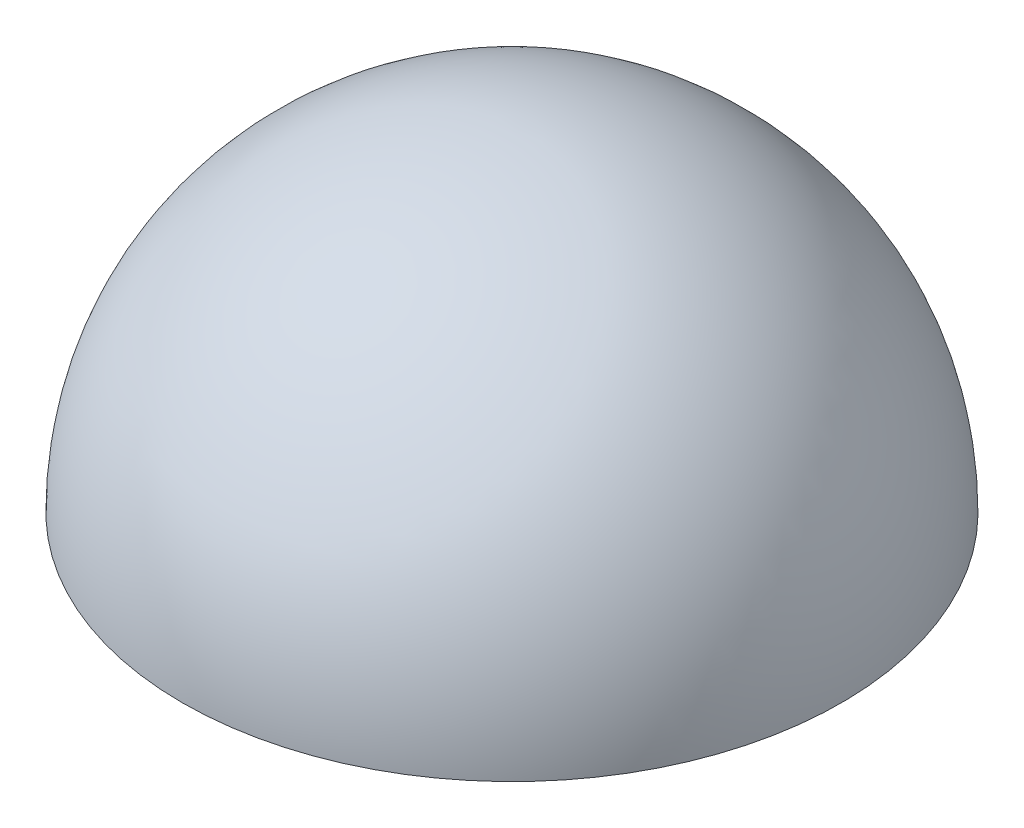
ISO-10303-21;
HEADER;
FILE_DESCRIPTION(('STEP AP214'),'2;1');
FILE_NAME('part.step','',(''),(''),'','','');
FILE_SCHEMA(('AUTOMOTIVE_DESIGN { 1 0 10303 214 1 1 1 1 }'));
ENDSEC;
DATA;
#1=APPLICATION_CONTEXT('core data for automotive mechanical design processes');
#2=APPLICATION_PROTOCOL_DEFINITION('international standard','automotive_design',2000,#1);
#3=PRODUCT_CONTEXT('',#1,'mechanical');
#4=PRODUCT('Part','Part','',(#3));
#5=PRODUCT_RELATED_PRODUCT_CATEGORY('part','',(#4));
#6=PRODUCT_DEFINITION_FORMATION('','',#4);
#7=PRODUCT_DEFINITION_CONTEXT('part definition',#1,'design');
#8=PRODUCT_DEFINITION('design','',#6,#7);
#9=PRODUCT_DEFINITION_SHAPE('','',#8);
#10=(LENGTH_UNIT() NAMED_UNIT(*) SI_UNIT(.MILLI.,.METRE.));
#11=(NAMED_UNIT(*) PLANE_ANGLE_UNIT() SI_UNIT($,.RADIAN.));
#12=(NAMED_UNIT(*) SI_UNIT($,.STERADIAN.) SOLID_ANGLE_UNIT());
#13=UNCERTAINTY_MEASURE_WITH_UNIT(LENGTH_MEASURE(1.E-05),#10,'distance_accuracy_value','');
#14=(GEOMETRIC_REPRESENTATION_CONTEXT(3) GLOBAL_UNCERTAINTY_ASSIGNED_CONTEXT((#13)) GLOBAL_UNIT_ASSIGNED_CONTEXT((#10,
#11,#12)) REPRESENTATION_CONTEXT('',''));
#15=CARTESIAN_POINT('',(0.,0.,0.));
#16=DIRECTION('',(0.,0.,1.));
#17=DIRECTION('',(1.,0.,0.));
#18=AXIS2_PLACEMENT_3D('',#15,#16,#17);
#19=CARTESIAN_POINT('',(0.,0.,0.));
#20=DIRECTION('',(0.,0.,1.));
#21=DIRECTION('',(1.,0.,0.));
#22=AXIS2_PLACEMENT_3D('',#19,#20,#21);
#23=SPHERICAL_SURFACE('',#22,4.);
#24=CARTESIAN_POINT('',(0.,0.,0.));
#25=DIRECTION('',(0.,-1.,0.));
#26=DIRECTION('',(0.,0.,1.));
#27=AXIS2_PLACEMENT_3D('',#24,#25,#26);
#28=SPHERICAL_SURFACE('',#27,4.);
#29=CARTESIAN_POINT('',(0.,0.,0.));
#30=DIRECTION('',(0.,-1.,0.));
#31=DIRECTION('',(0.,0.,1.));
#32=AXIS2_PLACEMENT_3D('',#29,#30,#31);
#33=CIRCLE('',#32,4.);
#34=CARTESIAN_POINT('',(0.,0.,4.));
#35=VERTEX_POINT('',#34);
#36=EDGE_CURVE('E10',#35,#35,#33,.T.);
#37=ORIENTED_EDGE('',*,*,#36,.F.);
#38=EDGE_LOOP('',(#37));
#39=FACE_BOUND('',#38,.T.);
#40=ADVANCED_FACE('F32',(#39),#28,.T.);
#41=CARTESIAN_POINT('',(0.,0.,0.));
#42=DIRECTION('',(0.,-1.,0.));
#43=DIRECTION('',(0.,0.,1.));
#44=AXIS2_PLACEMENT_3D('',#41,#42,#43);
#45=PLANE('',#44);
#46=ORIENTED_EDGE('',*,*,#36,.T.);
#47=EDGE_LOOP('',(#46));
#48=FACE_BOUND('',#47,.T.);
#49=ADVANCED_FACE('F39',(#48),#45,.T.);
#50=CLOSED_SHELL('',(#40,#49));
#51=MANIFOLD_SOLID_BREP('B2',#50);
#52=ADVANCED_BREP_SHAPE_REPRESENTATION('',(#18,#51),#14);
#53=SHAPE_DEFINITION_REPRESENTATION(#9,#52);
ENDSEC;
END-ISO-10303-21;
